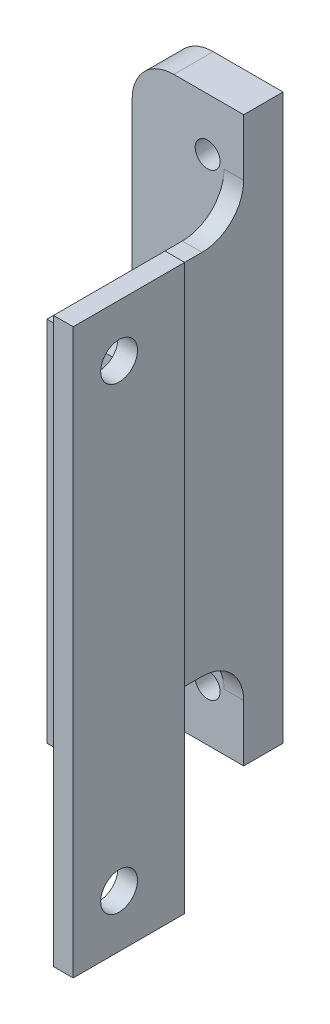
ISO-10303-21;
HEADER;
FILE_DESCRIPTION(('STEP AP214'),'2;1');
FILE_NAME('part.step','',(''),(''),'','','');
FILE_SCHEMA(('AUTOMOTIVE_DESIGN { 1 0 10303 214 1 1 1 1 }'));
ENDSEC;
DATA;
#1=APPLICATION_CONTEXT('core data for automotive mechanical design processes');
#2=APPLICATION_PROTOCOL_DEFINITION('international standard','automotive_design',2000,#1);
#3=PRODUCT_CONTEXT('',#1,'mechanical');
#4=PRODUCT('Part','Part','',(#3));
#5=PRODUCT_RELATED_PRODUCT_CATEGORY('part','',(#4));
#6=PRODUCT_DEFINITION_FORMATION('','',#4);
#7=PRODUCT_DEFINITION_CONTEXT('part definition',#1,'design');
#8=PRODUCT_DEFINITION('design','',#6,#7);
#9=PRODUCT_DEFINITION_SHAPE('','',#8);
#10=(LENGTH_UNIT() NAMED_UNIT(*) SI_UNIT(.MILLI.,.METRE.));
#11=(NAMED_UNIT(*) PLANE_ANGLE_UNIT() SI_UNIT($,.RADIAN.));
#12=(NAMED_UNIT(*) SI_UNIT($,.STERADIAN.) SOLID_ANGLE_UNIT());
#13=UNCERTAINTY_MEASURE_WITH_UNIT(LENGTH_MEASURE(1.E-05),#10,'distance_accuracy_value','');
#14=(GEOMETRIC_REPRESENTATION_CONTEXT(3) GLOBAL_UNCERTAINTY_ASSIGNED_CONTEXT((#13)) GLOBAL_UNIT_ASSIGNED_CONTEXT((#10,
#11,#12)) REPRESENTATION_CONTEXT('',''));
#15=CARTESIAN_POINT('',(0.,0.,0.));
#16=DIRECTION('',(0.,0.,1.));
#17=DIRECTION('',(1.,0.,0.));
#18=AXIS2_PLACEMENT_3D('',#15,#16,#17);
#19=CARTESIAN_POINT('',(-18.,43.,-17.));
#20=DIRECTION('',(-1.,0.,0.));
#21=DIRECTION('',(0.,0.,1.));
#22=AXIS2_PLACEMENT_3D('',#19,#20,#21);
#23=PLANE('',#22);
#24=DIRECTION('',(0.,-1.,0.));
#25=VECTOR('',#24,1.);
#26=CARTESIAN_POINT('',(-18.,43.,-41.));
#27=LINE('',#26,#25);
#28=CARTESIAN_POINT('',(-18.,34.35,-41.));
#29=VERTEX_POINT('',#28);
#30=CARTESIAN_POINT('',(-18.,-34.35,-41.));
#31=VERTEX_POINT('',#30);
#32=EDGE_CURVE('E266',#29,#31,#27,.T.);
#33=ORIENTED_EDGE('',*,*,#32,.T.);
#34=CARTESIAN_POINT('',(-18.,-34.35,-34.65));
#35=DIRECTION('',(-1.,0.,0.));
#36=DIRECTION('',(0.,0.,1.));
#37=AXIS2_PLACEMENT_3D('',#34,#35,#36);
#38=CIRCLE('',#37,6.35);
#39=CARTESIAN_POINT('',(-18.,-28.,-34.65));
#40=VERTEX_POINT('',#39);
#41=EDGE_CURVE('E289',#31,#40,#38,.F.);
#42=ORIENTED_EDGE('',*,*,#41,.T.);
#43=DIRECTION('',(0.,0.,1.));
#44=VECTOR('',#43,1.);
#45=CARTESIAN_POINT('',(-18.,-28.,-41.));
#46=LINE('',#45,#44);
#47=CARTESIAN_POINT('',(-18.,-28.,-14.));
#48=VERTEX_POINT('',#47);
#49=EDGE_CURVE('E196',#40,#48,#46,.T.);
#50=ORIENTED_EDGE('',*,*,#49,.T.);
#51=DIRECTION('',(0.,-1.,0.));
#52=VECTOR('',#51,1.);
#53=CARTESIAN_POINT('',(-18.,43.,-14.));
#54=LINE('',#53,#52);
#55=CARTESIAN_POINT('',(-18.,28.,-14.));
#56=VERTEX_POINT('',#55);
#57=EDGE_CURVE('E263',#56,#48,#54,.T.);
#58=ORIENTED_EDGE('',*,*,#57,.F.);
#59=DIRECTION('',(0.,0.,1.));
#60=VECTOR('',#59,1.);
#61=CARTESIAN_POINT('',(-18.,28.,-41.));
#62=LINE('',#61,#60);
#63=CARTESIAN_POINT('',(-18.,28.,-34.65));
#64=VERTEX_POINT('',#63);
#65=EDGE_CURVE('E210',#64,#56,#62,.T.);
#66=ORIENTED_EDGE('',*,*,#65,.F.);
#67=CARTESIAN_POINT('',(-18.,34.35,-34.65));
#68=DIRECTION('',(-1.,0.,0.));
#69=DIRECTION('',(0.,0.,1.));
#70=AXIS2_PLACEMENT_3D('',#67,#68,#69);
#71=CIRCLE('',#70,6.35);
#72=EDGE_CURVE('E284',#64,#29,#71,.F.);
#73=ORIENTED_EDGE('',*,*,#72,.T.);
#74=EDGE_LOOP('',(#33,#42,#50,#58,#66,#73));
#75=FACE_BOUND('',#74,.T.);
#76=ADVANCED_FACE('F34',(#75),#23,.T.);
#77=CARTESIAN_POINT('',(0.,43.,-14.));
#78=DIRECTION('',(0.,0.,1.));
#79=DIRECTION('',(1.,0.,0.));
#80=AXIS2_PLACEMENT_3D('',#77,#78,#79);
#81=PLANE('',#80);
#82=ORIENTED_EDGE('',*,*,#57,.T.);
#83=DIRECTION('',(-1.,0.,0.));
#84=VECTOR('',#83,1.);
#85=CARTESIAN_POINT('',(27.886890422961,-28.,-14.));
#86=LINE('',#85,#84);
#87=CARTESIAN_POINT('',(-3.,-28.,-14.));
#88=VERTEX_POINT('',#87);
#89=EDGE_CURVE('E201',#88,#48,#86,.T.);
#90=ORIENTED_EDGE('',*,*,#89,.F.);
#91=DIRECTION('',(0.,-1.,0.));
#92=VECTOR('',#91,1.);
#93=CARTESIAN_POINT('',(-3.,43.,-14.));
#94=LINE('',#93,#92);
#95=CARTESIAN_POINT('',(-3.,28.,-14.));
#96=VERTEX_POINT('',#95);
#97=EDGE_CURVE('E260',#96,#88,#94,.T.);
#98=ORIENTED_EDGE('',*,*,#97,.F.);
#99=DIRECTION('',(-1.,0.,0.));
#100=VECTOR('',#99,1.);
#101=CARTESIAN_POINT('',(27.886890422961,28.,-14.));
#102=LINE('',#101,#100);
#103=EDGE_CURVE('E212',#96,#56,#102,.T.);
#104=ORIENTED_EDGE('',*,*,#103,.T.);
#105=EDGE_LOOP('',(#82,#90,#98,#104));
#106=FACE_BOUND('',#105,.T.);
#107=ADVANCED_FACE('F342',(#106),#81,.T.);
#108=CARTESIAN_POINT('',(0.,43.,-17.));
#109=DIRECTION('',(0.,0.,1.));
#110=DIRECTION('',(1.,0.,0.));
#111=AXIS2_PLACEMENT_3D('',#108,#109,#110);
#112=PLANE('',#111);
#113=DIRECTION('',(1.,0.,0.));
#114=VECTOR('',#113,1.);
#115=CARTESIAN_POINT('',(0.,-28.,-17.));
#116=LINE('',#115,#114);
#117=CARTESIAN_POINT('',(-15.,-28.,-17.));
#118=VERTEX_POINT('',#117);
#119=CARTESIAN_POINT('',(-3.,-28.,-17.));
#120=VERTEX_POINT('',#119);
#121=EDGE_CURVE('E208',#118,#120,#116,.T.);
#122=ORIENTED_EDGE('',*,*,#121,.F.);
#123=DIRECTION('',(0.,-1.,0.));
#124=VECTOR('',#123,1.);
#125=CARTESIAN_POINT('',(-15.,43.,-17.));
#126=LINE('',#125,#124);
#127=CARTESIAN_POINT('',(-15.,28.,-17.));
#128=VERTEX_POINT('',#127);
#129=EDGE_CURVE('E240',#128,#118,#126,.T.);
#130=ORIENTED_EDGE('',*,*,#129,.F.);
#131=DIRECTION('',(1.,0.,0.));
#132=VECTOR('',#131,1.);
#133=CARTESIAN_POINT('',(0.,28.,-17.));
#134=LINE('',#133,#132);
#135=CARTESIAN_POINT('',(-3.,28.,-17.));
#136=VERTEX_POINT('',#135);
#137=EDGE_CURVE('E223',#128,#136,#134,.T.);
#138=ORIENTED_EDGE('',*,*,#137,.T.);
#139=DIRECTION('',(0.,-1.,0.));
#140=VECTOR('',#139,1.);
#141=CARTESIAN_POINT('',(-3.,43.,-17.));
#142=LINE('',#141,#140);
#143=CARTESIAN_POINT('',(-3.,43.,-17.));
#144=VERTEX_POINT('',#143);
#145=EDGE_CURVE('E218',#144,#136,#142,.T.);
#146=ORIENTED_EDGE('',*,*,#145,.F.);
#147=DIRECTION('',(-1.,0.,0.));
#148=VECTOR('',#147,1.);
#149=CARTESIAN_POINT('',(0.,43.,-17.));
#150=LINE('',#149,#148);
#151=CARTESIAN_POINT('',(0.,43.,-17.));
#152=VERTEX_POINT('',#151);
#153=EDGE_CURVE('E235',#152,#144,#150,.T.);
#154=ORIENTED_EDGE('',*,*,#153,.F.);
#155=DIRECTION('',(0.,-1.,0.));
#156=VECTOR('',#155,1.);
#157=CARTESIAN_POINT('',(0.,43.,-17.));
#158=LINE('',#157,#156);
#159=CARTESIAN_POINT('',(0.,-43.,-17.));
#160=VERTEX_POINT('',#159);
#161=EDGE_CURVE('E253',#152,#160,#158,.T.);
#162=ORIENTED_EDGE('',*,*,#161,.T.);
#163=DIRECTION('',(-1.,0.,0.));
#164=VECTOR('',#163,1.);
#165=CARTESIAN_POINT('',(0.,-43.,-17.));
#166=LINE('',#165,#164);
#167=CARTESIAN_POINT('',(-3.,-43.,-17.));
#168=VERTEX_POINT('',#167);
#169=EDGE_CURVE('E173',#160,#168,#166,.T.);
#170=ORIENTED_EDGE('',*,*,#169,.T.);
#171=DIRECTION('',(0.,-1.,0.));
#172=VECTOR('',#171,1.);
#173=CARTESIAN_POINT('',(-3.,43.,-17.));
#174=LINE('',#173,#172);
#175=EDGE_CURVE('E200',#120,#168,#174,.T.);
#176=ORIENTED_EDGE('',*,*,#175,.F.);
#177=EDGE_LOOP('',(#122,#130,#138,#146,#154,#162,#170,#176));
#178=FACE_BOUND('',#177,.T.);
#179=ADVANCED_FACE('F353',(#178),#112,.F.);
#180=CARTESIAN_POINT('',(-15.,43.,-17.));
#181=DIRECTION('',(-1.,0.,0.));
#182=DIRECTION('',(0.,0.,1.));
#183=AXIS2_PLACEMENT_3D('',#180,#181,#182);
#184=PLANE('',#183);
#185=DIRECTION('',(0.,0.,1.));
#186=VECTOR('',#185,1.);
#187=CARTESIAN_POINT('',(-15.,-28.,-17.));
#188=LINE('',#187,#186);
#189=CARTESIAN_POINT('',(-15.,-28.,-34.65));
#190=VERTEX_POINT('',#189);
#191=EDGE_CURVE('E272',#190,#118,#188,.T.);
#192=ORIENTED_EDGE('',*,*,#191,.F.);
#193=CARTESIAN_POINT('',(-15.,-34.35,-34.65));
#194=DIRECTION('',(-1.,0.,0.));
#195=DIRECTION('',(0.,0.,1.));
#196=AXIS2_PLACEMENT_3D('',#193,#194,#195);
#197=CIRCLE('',#196,6.35);
#198=CARTESIAN_POINT('',(-15.,-34.35,-41.));
#199=VERTEX_POINT('',#198);
#200=EDGE_CURVE('E291',#190,#199,#197,.T.);
#201=ORIENTED_EDGE('',*,*,#200,.T.);
#202=DIRECTION('',(0.,1.,0.));
#203=VECTOR('',#202,1.);
#204=CARTESIAN_POINT('',(-15.,43.,-41.));
#205=LINE('',#204,#203);
#206=CARTESIAN_POINT('',(-15.,-43.,-41.));
#207=VERTEX_POINT('',#206);
#208=EDGE_CURVE('E170',#207,#199,#205,.T.);
#209=ORIENTED_EDGE('',*,*,#208,.F.);
#210=DIRECTION('',(0.,0.,-1.));
#211=VECTOR('',#210,1.);
#212=CARTESIAN_POINT('',(-15.,-43.,-17.));
#213=LINE('',#212,#211);
#214=CARTESIAN_POINT('',(-15.,-43.,-47.));
#215=VERTEX_POINT('',#214);
#216=EDGE_CURVE('E162',#207,#215,#213,.T.);
#217=ORIENTED_EDGE('',*,*,#216,.T.);
#218=DIRECTION('',(0.,-1.,0.));
#219=VECTOR('',#218,1.);
#220=CARTESIAN_POINT('',(-15.,43.,-47.));
#221=LINE('',#220,#219);
#222=CARTESIAN_POINT('',(-15.,43.,-47.));
#223=VERTEX_POINT('',#222);
#224=EDGE_CURVE('E168',#223,#215,#221,.T.);
#225=ORIENTED_EDGE('',*,*,#224,.F.);
#226=DIRECTION('',(0.,0.,-1.));
#227=VECTOR('',#226,1.);
#228=CARTESIAN_POINT('',(-15.,43.,-17.));
#229=LINE('',#228,#227);
#230=CARTESIAN_POINT('',(-15.,43.,-41.));
#231=VERTEX_POINT('',#230);
#232=EDGE_CURVE('E238',#231,#223,#229,.T.);
#233=ORIENTED_EDGE('',*,*,#232,.F.);
#234=DIRECTION('',(0.,-1.,0.));
#235=VECTOR('',#234,1.);
#236=CARTESIAN_POINT('',(-15.,43.,-41.));
#237=LINE('',#236,#235);
#238=CARTESIAN_POINT('',(-15.,34.35,-41.));
#239=VERTEX_POINT('',#238);
#240=EDGE_CURVE('E220',#231,#239,#237,.T.);
#241=ORIENTED_EDGE('',*,*,#240,.T.);
#242=CARTESIAN_POINT('',(-15.,34.35,-34.65));
#243=DIRECTION('',(-1.,0.,0.));
#244=DIRECTION('',(0.,0.,1.));
#245=AXIS2_PLACEMENT_3D('',#242,#243,#244);
#246=CIRCLE('',#245,6.35);
#247=CARTESIAN_POINT('',(-15.,28.,-34.65));
#248=VERTEX_POINT('',#247);
#249=EDGE_CURVE('E287',#239,#248,#246,.T.);
#250=ORIENTED_EDGE('',*,*,#249,.T.);
#251=DIRECTION('',(0.,0.,1.));
#252=VECTOR('',#251,1.);
#253=CARTESIAN_POINT('',(-15.,28.,-17.));
#254=LINE('',#253,#252);
#255=EDGE_CURVE('E270',#248,#128,#254,.T.);
#256=ORIENTED_EDGE('',*,*,#255,.T.);
#257=ORIENTED_EDGE('',*,*,#129,.T.);
#258=EDGE_LOOP('',(#192,#201,#209,#217,#225,#233,#241,#250,#256,#257));
#259=FACE_BOUND('',#258,.T.);
#260=ADVANCED_FACE('F165',(#259),#184,.F.);
#261=CARTESIAN_POINT('',(0.,-43.,0.));
#262=DIRECTION('',(0.,-1.,0.));
#263=DIRECTION('',(-1.,0.,0.));
#264=AXIS2_PLACEMENT_3D('',#261,#262,#263);
#265=PLANE('',#264);
#266=DIRECTION('',(-1.,0.,0.));
#267=VECTOR('',#266,1.);
#268=CARTESIAN_POINT('',(-15.,-43.,-41.));
#269=LINE('',#268,#267);
#270=CARTESIAN_POINT('',(-25.65,-43.,-41.));
#271=VERTEX_POINT('',#270);
#272=EDGE_CURVE('E226',#207,#271,#269,.T.);
#273=ORIENTED_EDGE('',*,*,#272,.T.);
#274=DIRECTION('',(0.,0.,-1.));
#275=VECTOR('',#274,1.);
#276=CARTESIAN_POINT('',(-25.65,-43.,0.));
#277=LINE('',#276,#275);
#278=CARTESIAN_POINT('',(-25.65,-43.,-47.));
#279=VERTEX_POINT('',#278);
#280=EDGE_CURVE('E11',#271,#279,#277,.T.);
#281=ORIENTED_EDGE('',*,*,#280,.T.);
#282=DIRECTION('',(-1.,0.,0.));
#283=VECTOR('',#282,1.);
#284=CARTESIAN_POINT('',(-15.,-43.,-47.));
#285=LINE('',#284,#283);
#286=EDGE_CURVE('E176',#215,#279,#285,.T.);
#287=ORIENTED_EDGE('',*,*,#286,.F.);
#288=ORIENTED_EDGE('',*,*,#216,.F.);
#289=EDGE_LOOP('',(#273,#281,#287,#288));
#290=FACE_BOUND('',#289,.T.);
#291=ADVANCED_FACE('F177',(#290),#265,.T.);
#292=DIRECTION('',(0.,0.,-1.));
#293=VECTOR('',#292,1.);
#294=CARTESIAN_POINT('',(-3.,-43.,0.));
#295=LINE('',#294,#293);
#296=CARTESIAN_POINT('',(-3.,-43.,0.));
#297=VERTEX_POINT('',#296);
#298=EDGE_CURVE('E242',#297,#168,#295,.T.);
#299=ORIENTED_EDGE('',*,*,#298,.T.);
#300=ORIENTED_EDGE('',*,*,#169,.F.);
#301=DIRECTION('',(0.,0.,-1.));
#302=VECTOR('',#301,1.);
#303=CARTESIAN_POINT('',(0.,-43.,0.));
#304=LINE('',#303,#302);
#305=CARTESIAN_POINT('',(0.,-43.,0.));
#306=VERTEX_POINT('',#305);
#307=EDGE_CURVE('E247',#306,#160,#304,.T.);
#308=ORIENTED_EDGE('',*,*,#307,.F.);
#309=DIRECTION('',(-1.,0.,0.));
#310=VECTOR('',#309,1.);
#311=CARTESIAN_POINT('',(0.,-43.,0.));
#312=LINE('',#311,#310);
#313=EDGE_CURVE('E244',#306,#297,#312,.T.);
#314=ORIENTED_EDGE('',*,*,#313,.T.);
#315=EDGE_LOOP('',(#299,#300,#308,#314));
#316=FACE_BOUND('',#315,.T.);
#317=ADVANCED_FACE('F366',(#316),#265,.T.);
#318=CARTESIAN_POINT('',(0.,43.,0.));
#319=DIRECTION('',(0.,-1.,0.));
#320=DIRECTION('',(-1.,0.,0.));
#321=AXIS2_PLACEMENT_3D('',#318,#319,#320);
#322=PLANE('',#321);
#323=ORIENTED_EDGE('',*,*,#153,.T.);
#324=DIRECTION('',(0.,0.,-1.));
#325=VECTOR('',#324,1.);
#326=CARTESIAN_POINT('',(-3.,43.,0.));
#327=LINE('',#326,#325);
#328=CARTESIAN_POINT('',(-3.,43.,0.));
#329=VERTEX_POINT('',#328);
#330=EDGE_CURVE('E228',#329,#144,#327,.T.);
#331=ORIENTED_EDGE('',*,*,#330,.F.);
#332=DIRECTION('',(-1.,0.,0.));
#333=VECTOR('',#332,1.);
#334=CARTESIAN_POINT('',(0.,43.,0.));
#335=LINE('',#334,#333);
#336=CARTESIAN_POINT('',(0.,43.,0.));
#337=VERTEX_POINT('',#336);
#338=EDGE_CURVE('E230',#337,#329,#335,.T.);
#339=ORIENTED_EDGE('',*,*,#338,.F.);
#340=DIRECTION('',(0.,0.,-1.));
#341=VECTOR('',#340,1.);
#342=CARTESIAN_POINT('',(0.,43.,0.));
#343=LINE('',#342,#341);
#344=EDGE_CURVE('E233',#337,#152,#343,.T.);
#345=ORIENTED_EDGE('',*,*,#344,.T.);
#346=EDGE_LOOP('',(#323,#331,#339,#345));
#347=FACE_BOUND('',#346,.T.);
#348=ADVANCED_FACE('F356',(#347),#322,.F.);
#349=CARTESIAN_POINT('',(-32.,43.,-41.));
#350=DIRECTION('',(-1.,0.,0.));
#351=DIRECTION('',(0.,0.,1.));
#352=AXIS2_PLACEMENT_3D('',#349,#350,#351);
#353=PLANE('',#352);
#354=DIRECTION('',(0.,-1.,0.));
#355=VECTOR('',#354,1.);
#356=CARTESIAN_POINT('',(-32.,43.,-41.));
#357=LINE('',#356,#355);
#358=CARTESIAN_POINT('',(-32.,36.65,-41.));
#359=VERTEX_POINT('',#358);
#360=CARTESIAN_POINT('',(-32.,-36.65,-41.));
#361=VERTEX_POINT('',#360);
#362=EDGE_CURVE('E268',#359,#361,#357,.T.);
#363=ORIENTED_EDGE('',*,*,#362,.F.);
#364=DIRECTION('',(0.,0.,-1.));
#365=VECTOR('',#364,1.);
#366=CARTESIAN_POINT('',(-32.,36.65,-47.));
#367=LINE('',#366,#365);
#368=CARTESIAN_POINT('',(-32.,36.65,-47.));
#369=VERTEX_POINT('',#368);
#370=EDGE_CURVE('E307',#359,#369,#367,.T.);
#371=ORIENTED_EDGE('',*,*,#370,.T.);
#372=DIRECTION('',(0.,1.,0.));
#373=VECTOR('',#372,1.);
#374=CARTESIAN_POINT('',(-32.,-43.,-47.));
#375=LINE('',#374,#373);
#376=CARTESIAN_POINT('',(-32.,-36.65,-47.));
#377=VERTEX_POINT('',#376);
#378=EDGE_CURVE('E180',#377,#369,#375,.T.);
#379=ORIENTED_EDGE('',*,*,#378,.F.);
#380=DIRECTION('',(0.,0.,-1.));
#381=VECTOR('',#380,1.);
#382=CARTESIAN_POINT('',(-32.,-36.65,-41.));
#383=LINE('',#382,#381);
#384=EDGE_CURVE('E292',#377,#361,#383,.F.);
#385=ORIENTED_EDGE('',*,*,#384,.T.);
#386=EDGE_LOOP('',(#363,#371,#379,#385));
#387=FACE_BOUND('',#386,.T.);
#388=ADVANCED_FACE('F322',(#387),#353,.T.);
#389=CARTESIAN_POINT('',(-15.,43.,-41.));
#390=DIRECTION('',(0.,0.,1.));
#391=DIRECTION('',(1.,0.,0.));
#392=AXIS2_PLACEMENT_3D('',#389,#390,#391);
#393=PLANE('',#392);
#394=CARTESIAN_POINT('',(-20.5,-17.,-41.));
#395=DIRECTION('',(0.,0.,1.));
#396=DIRECTION('',(1.,0.,0.));
#397=AXIS2_PLACEMENT_3D('',#394,#395,#396);
#398=CIRCLE('',#397,1.89864999999998);
#399=CARTESIAN_POINT('',(-18.60135,-17.,-41.));
#400=VERTEX_POINT('',#399);
#401=EDGE_CURVE('E302',#400,#400,#398,.T.);
#402=ORIENTED_EDGE('',*,*,#401,.F.);
#403=EDGE_LOOP('',(#402));
#404=FACE_BOUND('',#403,.T.);
#405=CARTESIAN_POINT('',(-20.5,35.,-41.));
#406=DIRECTION('',(0.,0.,1.));
#407=DIRECTION('',(1.,0.,0.));
#408=AXIS2_PLACEMENT_3D('',#405,#406,#407);
#409=CIRCLE('',#408,1.89864999999998);
#410=CARTESIAN_POINT('',(-18.60135,35.,-41.));
#411=VERTEX_POINT('',#410);
#412=EDGE_CURVE('E298',#411,#411,#409,.T.);
#413=ORIENTED_EDGE('',*,*,#412,.F.);
#414=EDGE_LOOP('',(#413));
#415=FACE_BOUND('',#414,.T.);
#416=CARTESIAN_POINT('',(-20.5,17.,-41.));
#417=DIRECTION('',(0.,0.,1.));
#418=DIRECTION('',(1.,0.,0.));
#419=AXIS2_PLACEMENT_3D('',#416,#417,#418);
#420=CIRCLE('',#419,1.89864999999998);
#421=CARTESIAN_POINT('',(-18.60135,17.,-41.));
#422=VERTEX_POINT('',#421);
#423=EDGE_CURVE('E294',#422,#422,#420,.T.);
#424=ORIENTED_EDGE('',*,*,#423,.F.);
#425=EDGE_LOOP('',(#424));
#426=FACE_BOUND('',#425,.T.);
#427=CARTESIAN_POINT('',(-20.5,-35.,-41.));
#428=DIRECTION('',(0.,0.,1.));
#429=DIRECTION('',(1.,0.,0.));
#430=AXIS2_PLACEMENT_3D('',#427,#428,#429);
#431=CIRCLE('',#430,1.89864999999998);
#432=CARTESIAN_POINT('',(-18.60135,-35.,-41.));
#433=VERTEX_POINT('',#432);
#434=EDGE_CURVE('E186',#433,#433,#431,.T.);
#435=ORIENTED_EDGE('',*,*,#434,.F.);
#436=EDGE_LOOP('',(#435));
#437=FACE_BOUND('',#436,.T.);
#438=DIRECTION('',(-1.,0.,0.));
#439=VECTOR('',#438,1.);
#440=CARTESIAN_POINT('',(-15.,43.,-41.));
#441=LINE('',#440,#439);
#442=CARTESIAN_POINT('',(-25.65,43.,-41.));
#443=VERTEX_POINT('',#442);
#444=EDGE_CURVE('E172',#231,#443,#441,.T.);
#445=ORIENTED_EDGE('',*,*,#444,.T.);
#446=CARTESIAN_POINT('',(-25.65,36.65,-41.));
#447=DIRECTION('',(0.,0.,1.));
#448=DIRECTION('',(1.,0.,0.));
#449=AXIS2_PLACEMENT_3D('',#446,#447,#448);
#450=CIRCLE('',#449,6.35);
#451=EDGE_CURVE('E42',#443,#359,#450,.T.);
#452=ORIENTED_EDGE('',*,*,#451,.T.);
#453=ORIENTED_EDGE('',*,*,#362,.T.);
#454=CARTESIAN_POINT('',(-25.65,-36.65,-41.));
#455=DIRECTION('',(0.,0.,1.));
#456=DIRECTION('',(1.,0.,0.));
#457=AXIS2_PLACEMENT_3D('',#454,#455,#456);
#458=CIRCLE('',#457,6.35);
#459=EDGE_CURVE('E49',#361,#271,#458,.T.);
#460=ORIENTED_EDGE('',*,*,#459,.T.);
#461=ORIENTED_EDGE('',*,*,#272,.F.);
#462=ORIENTED_EDGE('',*,*,#208,.T.);
#463=DIRECTION('',(-1.,0.,0.));
#464=VECTOR('',#463,1.);
#465=CARTESIAN_POINT('',(-18.,-34.35,-41.));
#466=LINE('',#465,#464);
#467=EDGE_CURVE('E277',#199,#31,#466,.T.);
#468=ORIENTED_EDGE('',*,*,#467,.T.);
#469=ORIENTED_EDGE('',*,*,#32,.F.);
#470=DIRECTION('',(-1.,0.,0.));
#471=VECTOR('',#470,1.);
#472=CARTESIAN_POINT('',(-15.,34.35,-41.));
#473=LINE('',#472,#471);
#474=EDGE_CURVE('E280',#29,#239,#473,.F.);
#475=ORIENTED_EDGE('',*,*,#474,.T.);
#476=ORIENTED_EDGE('',*,*,#240,.F.);
#477=EDGE_LOOP('',(#445,#452,#453,#460,#461,#462,#468,#469,#475,#476));
#478=FACE_BOUND('',#477,.T.);
#479=ADVANCED_FACE('F317',(#404,#415,#426,#437,#478),#393,.T.);
#480=CARTESIAN_POINT('',(-3.,43.,0.));
#481=DIRECTION('',(-1.,0.,0.));
#482=DIRECTION('',(0.,0.,1.));
#483=AXIS2_PLACEMENT_3D('',#480,#481,#482);
#484=PLANE('',#483);
#485=CARTESIAN_POINT('',(-3.,-35.,-6.99999999999999));
#486=DIRECTION('',(-1.,0.,0.));
#487=DIRECTION('',(0.,0.,1.));
#488=AXIS2_PLACEMENT_3D('',#485,#486,#487);
#489=CIRCLE('',#488,2.8067);
#490=CARTESIAN_POINT('',(-3.,-35.,-4.19329999999999));
#491=VERTEX_POINT('',#490);
#492=EDGE_CURVE('E444',#491,#491,#489,.T.);
#493=ORIENTED_EDGE('',*,*,#492,.F.);
#494=EDGE_LOOP('',(#493));
#495=FACE_BOUND('',#494,.T.);
#496=CARTESIAN_POINT('',(-3.,35.,-6.99999999999999));
#497=DIRECTION('',(-1.,0.,0.));
#498=DIRECTION('',(0.,0.,1.));
#499=AXIS2_PLACEMENT_3D('',#496,#497,#498);
#500=CIRCLE('',#499,2.8067);
#501=CARTESIAN_POINT('',(-3.,35.,-4.19329999999999));
#502=VERTEX_POINT('',#501);
#503=EDGE_CURVE('E447',#502,#502,#500,.T.);
#504=ORIENTED_EDGE('',*,*,#503,.F.);
#505=EDGE_LOOP('',(#504));
#506=FACE_BOUND('',#505,.T.);
#507=ORIENTED_EDGE('',*,*,#298,.F.);
#508=DIRECTION('',(0.,-1.,0.));
#509=VECTOR('',#508,1.);
#510=CARTESIAN_POINT('',(-3.,43.,0.));
#511=LINE('',#510,#509);
#512=EDGE_CURVE('E258',#329,#297,#511,.T.);
#513=ORIENTED_EDGE('',*,*,#512,.F.);
#514=ORIENTED_EDGE('',*,*,#330,.T.);
#515=ORIENTED_EDGE('',*,*,#145,.T.);
#516=DIRECTION('',(0.,0.,-1.));
#517=VECTOR('',#516,1.);
#518=CARTESIAN_POINT('',(-3.,28.,-41.));
#519=LINE('',#518,#517);
#520=EDGE_CURVE('E215',#96,#136,#519,.T.);
#521=ORIENTED_EDGE('',*,*,#520,.F.);
#522=ORIENTED_EDGE('',*,*,#97,.T.);
#523=DIRECTION('',(0.,0.,-1.));
#524=VECTOR('',#523,1.);
#525=CARTESIAN_POINT('',(-3.,-28.,-41.));
#526=LINE('',#525,#524);
#527=EDGE_CURVE('E197',#88,#120,#526,.T.);
#528=ORIENTED_EDGE('',*,*,#527,.T.);
#529=ORIENTED_EDGE('',*,*,#175,.T.);
#530=EDGE_LOOP('',(#507,#513,#514,#515,#521,#522,#528,#529));
#531=FACE_BOUND('',#530,.T.);
#532=ADVANCED_FACE('F347',(#495,#506,#531),#484,.T.);
#533=CARTESIAN_POINT('',(0.,43.,0.));
#534=DIRECTION('',(0.,0.,1.));
#535=DIRECTION('',(1.,0.,0.));
#536=AXIS2_PLACEMENT_3D('',#533,#534,#535);
#537=PLANE('',#536);
#538=ORIENTED_EDGE('',*,*,#313,.F.);
#539=DIRECTION('',(0.,-1.,0.));
#540=VECTOR('',#539,1.);
#541=CARTESIAN_POINT('',(0.,43.,0.));
#542=LINE('',#541,#540);
#543=EDGE_CURVE('E256',#337,#306,#542,.T.);
#544=ORIENTED_EDGE('',*,*,#543,.F.);
#545=ORIENTED_EDGE('',*,*,#338,.T.);
#546=ORIENTED_EDGE('',*,*,#512,.T.);
#547=EDGE_LOOP('',(#538,#544,#545,#546));
#548=FACE_BOUND('',#547,.T.);
#549=ADVANCED_FACE('F433',(#548),#537,.T.);
#550=CARTESIAN_POINT('',(0.,43.,0.));
#551=DIRECTION('',(-1.,0.,0.));
#552=DIRECTION('',(0.,0.,1.));
#553=AXIS2_PLACEMENT_3D('',#550,#551,#552);
#554=PLANE('',#553);
#555=CARTESIAN_POINT('',(0.,-35.,-6.99999999999999));
#556=DIRECTION('',(-1.,0.,0.));
#557=DIRECTION('',(0.,0.,1.));
#558=AXIS2_PLACEMENT_3D('',#555,#556,#557);
#559=CIRCLE('',#558,2.8067);
#560=CARTESIAN_POINT('',(0.,-35.,-4.19329999999999));
#561=VERTEX_POINT('',#560);
#562=EDGE_CURVE('E449',#561,#561,#559,.T.);
#563=ORIENTED_EDGE('',*,*,#562,.T.);
#564=EDGE_LOOP('',(#563));
#565=FACE_BOUND('',#564,.T.);
#566=CARTESIAN_POINT('',(0.,35.,-6.99999999999999));
#567=DIRECTION('',(-1.,0.,0.));
#568=DIRECTION('',(0.,0.,1.));
#569=AXIS2_PLACEMENT_3D('',#566,#567,#568);
#570=CIRCLE('',#569,2.8067);
#571=CARTESIAN_POINT('',(0.,35.,-4.19329999999999));
#572=VERTEX_POINT('',#571);
#573=EDGE_CURVE('E448',#572,#572,#570,.T.);
#574=ORIENTED_EDGE('',*,*,#573,.T.);
#575=EDGE_LOOP('',(#574));
#576=FACE_BOUND('',#575,.T.);
#577=ORIENTED_EDGE('',*,*,#307,.T.);
#578=ORIENTED_EDGE('',*,*,#161,.F.);
#579=ORIENTED_EDGE('',*,*,#344,.F.);
#580=ORIENTED_EDGE('',*,*,#543,.T.);
#581=EDGE_LOOP('',(#577,#578,#579,#580));
#582=FACE_BOUND('',#581,.T.);
#583=ADVANCED_FACE('F361',(#565,#576,#582),#554,.F.);
#584=DIRECTION('',(1.,0.,0.));
#585=VECTOR('',#584,1.);
#586=CARTESIAN_POINT('',(-32.,43.,-47.));
#587=LINE('',#586,#585);
#588=CARTESIAN_POINT('',(-25.65,43.,-47.));
#589=VERTEX_POINT('',#588);
#590=EDGE_CURVE('E184',#589,#223,#587,.T.);
#591=ORIENTED_EDGE('',*,*,#590,.F.);
#592=DIRECTION('',(0.,0.,-1.));
#593=VECTOR('',#592,1.);
#594=CARTESIAN_POINT('',(-25.65,43.,-41.));
#595=LINE('',#594,#593);
#596=EDGE_CURVE('E57',#589,#443,#595,.F.);
#597=ORIENTED_EDGE('',*,*,#596,.T.);
#598=ORIENTED_EDGE('',*,*,#444,.F.);
#599=ORIENTED_EDGE('',*,*,#232,.T.);
#600=EDGE_LOOP('',(#591,#597,#598,#599));
#601=FACE_BOUND('',#600,.T.);
#602=ADVANCED_FACE('F326',(#601),#322,.F.);
#603=CARTESIAN_POINT('',(27.886890422961,28.,-41.));
#604=DIRECTION('',(0.,-1.,0.));
#605=DIRECTION('',(0.,0.,-1.));
#606=AXIS2_PLACEMENT_3D('',#603,#604,#605);
#607=PLANE('',#606);
#608=ORIENTED_EDGE('',*,*,#255,.F.);
#609=DIRECTION('',(-1.,0.,0.));
#610=VECTOR('',#609,1.);
#611=CARTESIAN_POINT('',(27.886890422961,28.,-34.65));
#612=LINE('',#611,#610);
#613=EDGE_CURVE('E274',#248,#64,#612,.T.);
#614=ORIENTED_EDGE('',*,*,#613,.T.);
#615=ORIENTED_EDGE('',*,*,#65,.T.);
#616=ORIENTED_EDGE('',*,*,#103,.F.);
#617=ORIENTED_EDGE('',*,*,#520,.T.);
#618=ORIENTED_EDGE('',*,*,#137,.F.);
#619=EDGE_LOOP('',(#608,#614,#615,#616,#617,#618));
#620=FACE_BOUND('',#619,.T.);
#621=ADVANCED_FACE('F335',(#620),#607,.F.);
#622=CARTESIAN_POINT('',(27.886890422961,-28.,-41.));
#623=DIRECTION('',(0.,-1.,0.));
#624=DIRECTION('',(0.,0.,-1.));
#625=AXIS2_PLACEMENT_3D('',#622,#623,#624);
#626=PLANE('',#625);
#627=ORIENTED_EDGE('',*,*,#49,.F.);
#628=DIRECTION('',(-1.,0.,0.));
#629=VECTOR('',#628,1.);
#630=CARTESIAN_POINT('',(-15.,-28.,-34.65));
#631=LINE('',#630,#629);
#632=EDGE_CURVE('E282',#40,#190,#631,.F.);
#633=ORIENTED_EDGE('',*,*,#632,.T.);
#634=ORIENTED_EDGE('',*,*,#191,.T.);
#635=ORIENTED_EDGE('',*,*,#121,.T.);
#636=ORIENTED_EDGE('',*,*,#527,.F.);
#637=ORIENTED_EDGE('',*,*,#89,.T.);
#638=EDGE_LOOP('',(#627,#633,#634,#635,#636,#637));
#639=FACE_BOUND('',#638,.T.);
#640=ADVANCED_FACE('F401',(#639),#626,.T.);
#641=CARTESIAN_POINT('',(27.886890422961,34.35,-34.65));
#642=DIRECTION('',(-1.,0.,0.));
#643=DIRECTION('',(0.,0.,1.));
#644=AXIS2_PLACEMENT_3D('',#641,#642,#643);
#645=CYLINDRICAL_SURFACE('',#644,6.35);
#646=ORIENTED_EDGE('',*,*,#249,.F.);
#647=ORIENTED_EDGE('',*,*,#474,.F.);
#648=ORIENTED_EDGE('',*,*,#72,.F.);
#649=ORIENTED_EDGE('',*,*,#613,.F.);
#650=EDGE_LOOP('',(#646,#647,#648,#649));
#651=FACE_BOUND('',#650,.T.);
#652=ADVANCED_FACE('F332',(#651),#645,.F.);
#653=CARTESIAN_POINT('',(-15.,-34.35,-34.65));
#654=DIRECTION('',(1.,0.,0.));
#655=DIRECTION('',(0.,0.,-1.));
#656=AXIS2_PLACEMENT_3D('',#653,#654,#655);
#657=CYLINDRICAL_SURFACE('',#656,6.35);
#658=ORIENTED_EDGE('',*,*,#200,.F.);
#659=ORIENTED_EDGE('',*,*,#632,.F.);
#660=ORIENTED_EDGE('',*,*,#41,.F.);
#661=ORIENTED_EDGE('',*,*,#467,.F.);
#662=EDGE_LOOP('',(#658,#659,#660,#661));
#663=FACE_BOUND('',#662,.T.);
#664=ADVANCED_FACE('F373',(#663),#657,.F.);
#665=CARTESIAN_POINT('',(0.,0.,-47.));
#666=DIRECTION('',(0.,0.,-1.));
#667=DIRECTION('',(-1.,0.,0.));
#668=AXIS2_PLACEMENT_3D('',#665,#666,#667);
#669=PLANE('',#668);
#670=CARTESIAN_POINT('',(-20.5,-17.,-47.));
#671=DIRECTION('',(0.,0.,-1.));
#672=DIRECTION('',(-1.,0.,0.));
#673=AXIS2_PLACEMENT_3D('',#670,#671,#672);
#674=CIRCLE('',#673,1.89864999999999);
#675=CARTESIAN_POINT('',(-22.39865,-17.,-47.));
#676=VERTEX_POINT('',#675);
#677=EDGE_CURVE('E305',#676,#676,#674,.T.);
#678=ORIENTED_EDGE('',*,*,#677,.F.);
#679=EDGE_LOOP('',(#678));
#680=FACE_BOUND('',#679,.T.);
#681=CARTESIAN_POINT('',(-20.5,35.,-47.));
#682=DIRECTION('',(0.,0.,-1.));
#683=DIRECTION('',(-1.,0.,0.));
#684=AXIS2_PLACEMENT_3D('',#681,#682,#683);
#685=CIRCLE('',#684,1.89864999999999);
#686=CARTESIAN_POINT('',(-22.39865,35.,-47.));
#687=VERTEX_POINT('',#686);
#688=EDGE_CURVE('E301',#687,#687,#685,.T.);
#689=ORIENTED_EDGE('',*,*,#688,.F.);
#690=EDGE_LOOP('',(#689));
#691=FACE_BOUND('',#690,.T.);
#692=CARTESIAN_POINT('',(-20.5,17.,-47.));
#693=DIRECTION('',(0.,0.,-1.));
#694=DIRECTION('',(-1.,0.,0.));
#695=AXIS2_PLACEMENT_3D('',#692,#693,#694);
#696=CIRCLE('',#695,1.89864999999999);
#697=CARTESIAN_POINT('',(-22.39865,17.,-47.));
#698=VERTEX_POINT('',#697);
#699=EDGE_CURVE('E297',#698,#698,#696,.T.);
#700=ORIENTED_EDGE('',*,*,#699,.F.);
#701=EDGE_LOOP('',(#700));
#702=FACE_BOUND('',#701,.T.);
#703=CARTESIAN_POINT('',(-20.5,-35.,-47.));
#704=DIRECTION('',(0.,0.,-1.));
#705=DIRECTION('',(-1.,0.,0.));
#706=AXIS2_PLACEMENT_3D('',#703,#704,#705);
#707=CIRCLE('',#706,1.89864999999999);
#708=CARTESIAN_POINT('',(-22.39865,-35.,-47.));
#709=VERTEX_POINT('',#708);
#710=EDGE_CURVE('E189',#709,#709,#707,.T.);
#711=ORIENTED_EDGE('',*,*,#710,.F.);
#712=EDGE_LOOP('',(#711));
#713=FACE_BOUND('',#712,.T.);
#714=ORIENTED_EDGE('',*,*,#378,.T.);
#715=CARTESIAN_POINT('',(-25.65,36.65,-47.));
#716=DIRECTION('',(0.,0.,-1.));
#717=DIRECTION('',(-1.,0.,0.));
#718=AXIS2_PLACEMENT_3D('',#715,#716,#717);
#719=CIRCLE('',#718,6.35);
#720=EDGE_CURVE('E312',#369,#589,#719,.T.);
#721=ORIENTED_EDGE('',*,*,#720,.T.);
#722=ORIENTED_EDGE('',*,*,#590,.T.);
#723=ORIENTED_EDGE('',*,*,#224,.T.);
#724=ORIENTED_EDGE('',*,*,#286,.T.);
#725=CARTESIAN_POINT('',(-25.65,-36.65,-47.));
#726=DIRECTION('',(0.,0.,-1.));
#727=DIRECTION('',(-1.,0.,0.));
#728=AXIS2_PLACEMENT_3D('',#725,#726,#727);
#729=CIRCLE('',#728,6.35);
#730=EDGE_CURVE('E310',#279,#377,#729,.T.);
#731=ORIENTED_EDGE('',*,*,#730,.T.);
#732=EDGE_LOOP('',(#714,#721,#722,#723,#724,#731));
#733=FACE_BOUND('',#732,.T.);
#734=ADVANCED_FACE('F183',(#680,#691,#702,#713,#733),#669,.T.);
#735=CARTESIAN_POINT('',(-20.5,-35.,-47.));
#736=DIRECTION('',(0.,0.,-1.));
#737=DIRECTION('',(-1.,0.,0.));
#738=AXIS2_PLACEMENT_3D('',#735,#736,#737);
#739=CYLINDRICAL_SURFACE('',#738,1.89864999999998);
#740=ORIENTED_EDGE('',*,*,#434,.T.);
#741=EDGE_LOOP('',(#740));
#742=FACE_BOUND('',#741,.T.);
#743=ORIENTED_EDGE('',*,*,#710,.T.);
#744=EDGE_LOOP('',(#743));
#745=FACE_BOUND('',#744,.T.);
#746=ADVANCED_FACE('F406',(#742,#745),#739,.F.);
#747=CARTESIAN_POINT('',(-20.5,17.,-47.));
#748=DIRECTION('',(0.,0.,-1.));
#749=DIRECTION('',(-1.,0.,0.));
#750=AXIS2_PLACEMENT_3D('',#747,#748,#749);
#751=CYLINDRICAL_SURFACE('',#750,1.89864999999998);
#752=ORIENTED_EDGE('',*,*,#423,.T.);
#753=EDGE_LOOP('',(#752));
#754=FACE_BOUND('',#753,.T.);
#755=ORIENTED_EDGE('',*,*,#699,.T.);
#756=EDGE_LOOP('',(#755));
#757=FACE_BOUND('',#756,.T.);
#758=ADVANCED_FACE('F412',(#754,#757),#751,.F.);
#759=CARTESIAN_POINT('',(-20.5,35.,-47.));
#760=DIRECTION('',(0.,0.,-1.));
#761=DIRECTION('',(-1.,0.,0.));
#762=AXIS2_PLACEMENT_3D('',#759,#760,#761);
#763=CYLINDRICAL_SURFACE('',#762,1.89864999999998);
#764=ORIENTED_EDGE('',*,*,#412,.T.);
#765=EDGE_LOOP('',(#764));
#766=FACE_BOUND('',#765,.T.);
#767=ORIENTED_EDGE('',*,*,#688,.T.);
#768=EDGE_LOOP('',(#767));
#769=FACE_BOUND('',#768,.T.);
#770=ADVANCED_FACE('F469',(#766,#769),#763,.F.);
#771=CARTESIAN_POINT('',(-20.5,-17.,-47.));
#772=DIRECTION('',(0.,0.,-1.));
#773=DIRECTION('',(-1.,0.,0.));
#774=AXIS2_PLACEMENT_3D('',#771,#772,#773);
#775=CYLINDRICAL_SURFACE('',#774,1.89864999999998);
#776=ORIENTED_EDGE('',*,*,#401,.T.);
#777=EDGE_LOOP('',(#776));
#778=FACE_BOUND('',#777,.T.);
#779=ORIENTED_EDGE('',*,*,#677,.T.);
#780=EDGE_LOOP('',(#779));
#781=FACE_BOUND('',#780,.T.);
#782=ADVANCED_FACE('F385',(#778,#781),#775,.F.);
#783=CARTESIAN_POINT('',(-25.65,36.65,-41.));
#784=DIRECTION('',(0.,0.,1.));
#785=DIRECTION('',(1.,0.,0.));
#786=AXIS2_PLACEMENT_3D('',#783,#784,#785);
#787=CYLINDRICAL_SURFACE('',#786,6.35);
#788=ORIENTED_EDGE('',*,*,#451,.F.);
#789=ORIENTED_EDGE('',*,*,#596,.F.);
#790=ORIENTED_EDGE('',*,*,#720,.F.);
#791=ORIENTED_EDGE('',*,*,#370,.F.);
#792=EDGE_LOOP('',(#788,#789,#790,#791));
#793=FACE_BOUND('',#792,.T.);
#794=ADVANCED_FACE('F325',(#793),#787,.T.);
#795=CARTESIAN_POINT('',(-25.65,-36.65,0.));
#796=DIRECTION('',(0.,0.,-1.));
#797=DIRECTION('',(-1.,0.,0.));
#798=AXIS2_PLACEMENT_3D('',#795,#796,#797);
#799=CYLINDRICAL_SURFACE('',#798,6.35);
#800=ORIENTED_EDGE('',*,*,#459,.F.);
#801=ORIENTED_EDGE('',*,*,#384,.F.);
#802=ORIENTED_EDGE('',*,*,#730,.F.);
#803=ORIENTED_EDGE('',*,*,#280,.F.);
#804=EDGE_LOOP('',(#800,#801,#802,#803));
#805=FACE_BOUND('',#804,.T.);
#806=ADVANCED_FACE('F36',(#805),#799,.T.);
#807=CARTESIAN_POINT('',(-3.,35.,-6.99999999999999));
#808=DIRECTION('',(-1.,0.,0.));
#809=DIRECTION('',(0.,0.,1.));
#810=AXIS2_PLACEMENT_3D('',#807,#808,#809);
#811=CYLINDRICAL_SURFACE('',#810,2.8067);
#812=ORIENTED_EDGE('',*,*,#503,.T.);
#813=EDGE_LOOP('',(#812));
#814=FACE_BOUND('',#813,.T.);
#815=ORIENTED_EDGE('',*,*,#573,.F.);
#816=EDGE_LOOP('',(#815));
#817=FACE_BOUND('',#816,.T.);
#818=ADVANCED_FACE('F377',(#814,#817),#811,.F.);
#819=CARTESIAN_POINT('',(-3.,-35.,-6.99999999999999));
#820=DIRECTION('',(-1.,0.,0.));
#821=DIRECTION('',(0.,0.,1.));
#822=AXIS2_PLACEMENT_3D('',#819,#820,#821);
#823=CYLINDRICAL_SURFACE('',#822,2.8067);
#824=ORIENTED_EDGE('',*,*,#492,.T.);
#825=EDGE_LOOP('',(#824));
#826=FACE_BOUND('',#825,.T.);
#827=ORIENTED_EDGE('',*,*,#562,.F.);
#828=EDGE_LOOP('',(#827));
#829=FACE_BOUND('',#828,.T.);
#830=ADVANCED_FACE('F382',(#826,#829),#823,.F.);
#831=CLOSED_SHELL('',(#76,#107,#179,#260,#291,#317,#348,#388,#479,#532,#549,#583,#602,#621,#640,
#652,#664,#734,#746,#758,#770,#782,#794,#806,#818,#830));
#832=MANIFOLD_SOLID_BREP('B2',#831);
#833=ADVANCED_BREP_SHAPE_REPRESENTATION('',(#18,#832),#14);
#834=SHAPE_DEFINITION_REPRESENTATION(#9,#833);
ENDSEC;
END-ISO-10303-21;
